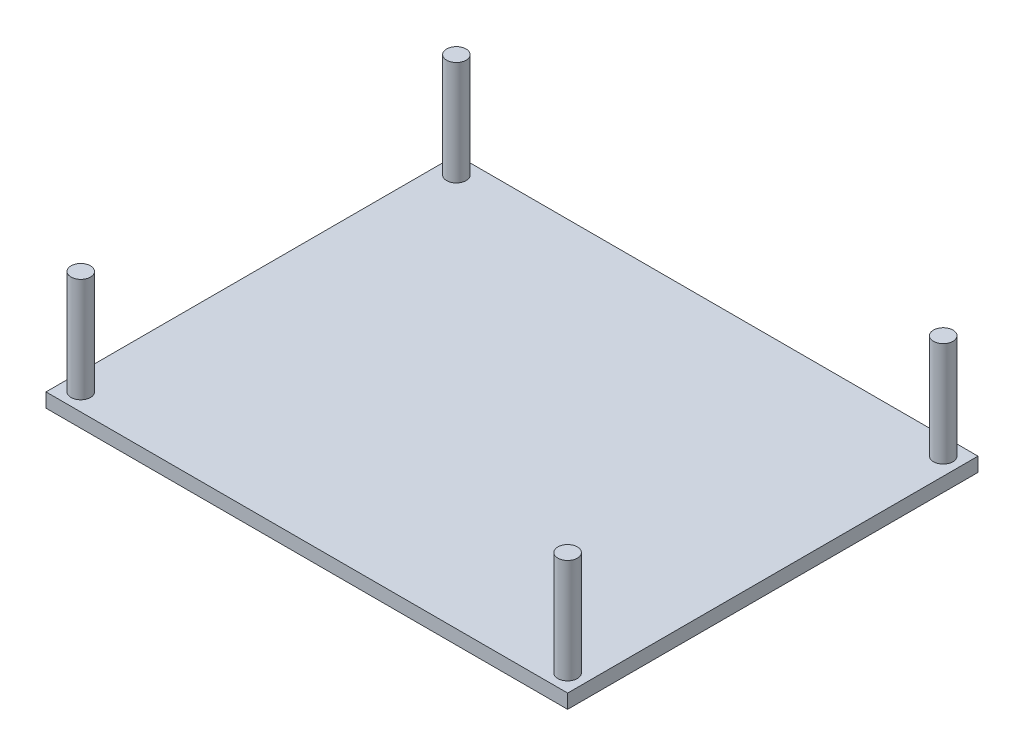
ISO-10303-21;
HEADER;
FILE_DESCRIPTION(('STEP AP214'),'2;1');
FILE_NAME('part.step','',(''),(''),'','','');
FILE_SCHEMA(('AUTOMOTIVE_DESIGN { 1 0 10303 214 1 1 1 1 }'));
ENDSEC;
DATA;
#1=APPLICATION_CONTEXT('core data for automotive mechanical design processes');
#2=APPLICATION_PROTOCOL_DEFINITION('international standard','automotive_design',2000,#1);
#3=PRODUCT_CONTEXT('',#1,'mechanical');
#4=PRODUCT('Part','Part','',(#3));
#5=PRODUCT_RELATED_PRODUCT_CATEGORY('part','',(#4));
#6=PRODUCT_DEFINITION_FORMATION('','',#4);
#7=PRODUCT_DEFINITION_CONTEXT('part definition',#1,'design');
#8=PRODUCT_DEFINITION('design','',#6,#7);
#9=PRODUCT_DEFINITION_SHAPE('','',#8);
#10=(LENGTH_UNIT() NAMED_UNIT(*) SI_UNIT(.MILLI.,.METRE.));
#11=(NAMED_UNIT(*) PLANE_ANGLE_UNIT() SI_UNIT($,.RADIAN.));
#12=(NAMED_UNIT(*) SI_UNIT($,.STERADIAN.) SOLID_ANGLE_UNIT());
#13=UNCERTAINTY_MEASURE_WITH_UNIT(LENGTH_MEASURE(1.E-05),#10,'distance_accuracy_value','');
#14=(GEOMETRIC_REPRESENTATION_CONTEXT(3) GLOBAL_UNCERTAINTY_ASSIGNED_CONTEXT((#13)) GLOBAL_UNIT_ASSIGNED_CONTEXT((#10,
#11,#12)) REPRESENTATION_CONTEXT('',''));
#15=CARTESIAN_POINT('',(0.,0.,0.));
#16=DIRECTION('',(0.,0.,1.));
#17=DIRECTION('',(1.,0.,0.));
#18=AXIS2_PLACEMENT_3D('',#15,#16,#17);
#19=CARTESIAN_POINT('',(0.,-2.032,0.));
#20=DIRECTION('',(-1.,0.,0.));
#21=DIRECTION('',(0.,0.,1.));
#22=AXIS2_PLACEMENT_3D('',#19,#20,#21);
#23=PLANE('',#22);
#24=DIRECTION('',(0.,0.,1.));
#25=VECTOR('',#24,1.);
#26=CARTESIAN_POINT('',(0.,0.,0.));
#27=LINE('',#26,#25);
#28=CARTESIAN_POINT('',(0.,0.,-59.));
#29=VERTEX_POINT('',#28);
#30=CARTESIAN_POINT('',(0.,0.,0.));
#31=VERTEX_POINT('',#30);
#32=EDGE_CURVE('E101',#29,#31,#27,.T.);
#33=ORIENTED_EDGE('',*,*,#32,.F.);
#34=DIRECTION('',(0.,1.,0.));
#35=VECTOR('',#34,1.);
#36=CARTESIAN_POINT('',(0.,-2.032,-59.));
#37=LINE('',#36,#35);
#38=CARTESIAN_POINT('',(0.,-2.032,-59.));
#39=VERTEX_POINT('',#38);
#40=EDGE_CURVE('E49',#39,#29,#37,.T.);
#41=ORIENTED_EDGE('',*,*,#40,.F.);
#42=DIRECTION('',(0.,0.,1.));
#43=VECTOR('',#42,1.);
#44=CARTESIAN_POINT('',(0.,-2.032,0.));
#45=LINE('',#44,#43);
#46=CARTESIAN_POINT('',(0.,-2.032,0.));
#47=VERTEX_POINT('',#46);
#48=EDGE_CURVE('E94',#39,#47,#45,.T.);
#49=ORIENTED_EDGE('',*,*,#48,.T.);
#50=DIRECTION('',(0.,1.,0.));
#51=VECTOR('',#50,1.);
#52=CARTESIAN_POINT('',(0.,-2.032,0.));
#53=LINE('',#52,#51);
#54=EDGE_CURVE('E77',#47,#31,#53,.T.);
#55=ORIENTED_EDGE('',*,*,#54,.T.);
#56=EDGE_LOOP('',(#33,#41,#49,#55));
#57=FACE_BOUND('',#56,.T.);
#58=ADVANCED_FACE('F33',(#57),#23,.T.);
#59=CARTESIAN_POINT('',(0.,-2.032,-59.));
#60=DIRECTION('',(0.,0.,-1.));
#61=DIRECTION('',(-1.,0.,0.));
#62=AXIS2_PLACEMENT_3D('',#59,#60,#61);
#63=PLANE('',#62);
#64=DIRECTION('',(-1.,0.,0.));
#65=VECTOR('',#64,1.);
#66=CARTESIAN_POINT('',(0.,0.,-59.));
#67=LINE('',#66,#65);
#68=CARTESIAN_POINT('',(75.,0.,-59.));
#69=VERTEX_POINT('',#68);
#70=EDGE_CURVE('E96',#69,#29,#67,.T.);
#71=ORIENTED_EDGE('',*,*,#70,.F.);
#72=DIRECTION('',(0.,1.,0.));
#73=VECTOR('',#72,1.);
#74=CARTESIAN_POINT('',(75.,-2.032,-59.));
#75=LINE('',#74,#73);
#76=CARTESIAN_POINT('',(75.,-2.032,-59.));
#77=VERTEX_POINT('',#76);
#78=EDGE_CURVE('E66',#77,#69,#75,.T.);
#79=ORIENTED_EDGE('',*,*,#78,.F.);
#80=DIRECTION('',(-1.,0.,0.));
#81=VECTOR('',#80,1.);
#82=CARTESIAN_POINT('',(0.,-2.032,-59.));
#83=LINE('',#82,#81);
#84=EDGE_CURVE('E91',#77,#39,#83,.T.);
#85=ORIENTED_EDGE('',*,*,#84,.T.);
#86=ORIENTED_EDGE('',*,*,#40,.T.);
#87=EDGE_LOOP('',(#71,#79,#85,#86));
#88=FACE_BOUND('',#87,.T.);
#89=ADVANCED_FACE('F133',(#88),#63,.T.);
#90=CARTESIAN_POINT('',(75.,-2.032,0.));
#91=DIRECTION('',(1.,0.,0.));
#92=DIRECTION('',(0.,0.,-1.));
#93=AXIS2_PLACEMENT_3D('',#90,#91,#92);
#94=PLANE('',#93);
#95=DIRECTION('',(0.,0.,-1.));
#96=VECTOR('',#95,1.);
#97=CARTESIAN_POINT('',(75.,0.,0.));
#98=LINE('',#97,#96);
#99=CARTESIAN_POINT('',(75.,0.,0.));
#100=VERTEX_POINT('',#99);
#101=EDGE_CURVE('E85',#100,#69,#98,.T.);
#102=ORIENTED_EDGE('',*,*,#101,.F.);
#103=DIRECTION('',(0.,1.,0.));
#104=VECTOR('',#103,1.);
#105=CARTESIAN_POINT('',(75.,-2.032,0.));
#106=LINE('',#105,#104);
#107=CARTESIAN_POINT('',(75.,-2.032,0.));
#108=VERTEX_POINT('',#107);
#109=EDGE_CURVE('E80',#108,#100,#106,.T.);
#110=ORIENTED_EDGE('',*,*,#109,.F.);
#111=DIRECTION('',(0.,0.,-1.));
#112=VECTOR('',#111,1.);
#113=CARTESIAN_POINT('',(75.,-2.032,0.));
#114=LINE('',#113,#112);
#115=EDGE_CURVE('E83',#108,#77,#114,.T.);
#116=ORIENTED_EDGE('',*,*,#115,.T.);
#117=ORIENTED_EDGE('',*,*,#78,.T.);
#118=EDGE_LOOP('',(#102,#110,#116,#117));
#119=FACE_BOUND('',#118,.T.);
#120=ADVANCED_FACE('F82',(#119),#94,.T.);
#121=CARTESIAN_POINT('',(0.,-2.032,0.));
#122=DIRECTION('',(0.,0.,1.));
#123=DIRECTION('',(1.,0.,0.));
#124=AXIS2_PLACEMENT_3D('',#121,#122,#123);
#125=PLANE('',#124);
#126=DIRECTION('',(1.,0.,0.));
#127=VECTOR('',#126,1.);
#128=CARTESIAN_POINT('',(0.,0.,0.));
#129=LINE('',#128,#127);
#130=EDGE_CURVE('E104',#31,#100,#129,.T.);
#131=ORIENTED_EDGE('',*,*,#130,.F.);
#132=ORIENTED_EDGE('',*,*,#54,.F.);
#133=DIRECTION('',(1.,0.,0.));
#134=VECTOR('',#133,1.);
#135=CARTESIAN_POINT('',(0.,-2.032,0.));
#136=LINE('',#135,#134);
#137=EDGE_CURVE('E90',#47,#108,#136,.T.);
#138=ORIENTED_EDGE('',*,*,#137,.T.);
#139=ORIENTED_EDGE('',*,*,#109,.T.);
#140=EDGE_LOOP('',(#131,#132,#138,#139));
#141=FACE_BOUND('',#140,.T.);
#142=ADVANCED_FACE('F93',(#141),#125,.T.);
#143=CARTESIAN_POINT('',(0.,-2.032,0.));
#144=DIRECTION('',(0.,-1.,0.));
#145=DIRECTION('',(0.,0.,-1.));
#146=AXIS2_PLACEMENT_3D('',#143,#144,#145);
#147=PLANE('',#146);
#148=ORIENTED_EDGE('',*,*,#48,.F.);
#149=ORIENTED_EDGE('',*,*,#84,.F.);
#150=ORIENTED_EDGE('',*,*,#115,.F.);
#151=ORIENTED_EDGE('',*,*,#137,.F.);
#152=EDGE_LOOP('',(#148,#149,#150,#151));
#153=FACE_BOUND('',#152,.T.);
#154=ADVANCED_FACE('F89',(#153),#147,.T.);
#155=CARTESIAN_POINT('',(0.,0.,0.));
#156=DIRECTION('',(0.,-1.,0.));
#157=DIRECTION('',(0.,0.,-1.));
#158=AXIS2_PLACEMENT_3D('',#155,#156,#157);
#159=PLANE('',#158);
#160=CARTESIAN_POINT('',(2.5,0.,-56.5));
#161=DIRECTION('',(0.,-1.,0.));
#162=DIRECTION('',(0.,0.,-1.));
#163=AXIS2_PLACEMENT_3D('',#160,#161,#162);
#164=CIRCLE('',#163,1.399999994);
#165=CARTESIAN_POINT('',(2.5,0.,-57.899999994));
#166=VERTEX_POINT('',#165);
#167=EDGE_CURVE('E11',#166,#166,#164,.F.);
#168=ORIENTED_EDGE('',*,*,#167,.F.);
#169=EDGE_LOOP('',(#168));
#170=FACE_BOUND('',#169,.T.);
#171=CARTESIAN_POINT('',(72.5,0.,-56.5));
#172=DIRECTION('',(0.,-1.,0.));
#173=DIRECTION('',(0.,0.,-1.));
#174=AXIS2_PLACEMENT_3D('',#171,#172,#173);
#175=CIRCLE('',#174,1.4);
#176=CARTESIAN_POINT('',(72.5,0.,-57.9));
#177=VERTEX_POINT('',#176);
#178=EDGE_CURVE('E41',#177,#177,#175,.F.);
#179=ORIENTED_EDGE('',*,*,#178,.F.);
#180=EDGE_LOOP('',(#179));
#181=FACE_BOUND('',#180,.T.);
#182=CARTESIAN_POINT('',(72.5,0.,-2.5));
#183=DIRECTION('',(0.,-1.,0.));
#184=DIRECTION('',(0.,0.,-1.));
#185=AXIS2_PLACEMENT_3D('',#182,#183,#184);
#186=CIRCLE('',#185,1.4);
#187=CARTESIAN_POINT('',(72.5,0.,-3.90000000000001));
#188=VERTEX_POINT('',#187);
#189=EDGE_CURVE('E116',#188,#188,#186,.F.);
#190=ORIENTED_EDGE('',*,*,#189,.F.);
#191=EDGE_LOOP('',(#190));
#192=FACE_BOUND('',#191,.T.);
#193=CARTESIAN_POINT('',(2.5,0.,-2.5));
#194=DIRECTION('',(0.,-1.,0.));
#195=DIRECTION('',(0.,0.,-1.));
#196=AXIS2_PLACEMENT_3D('',#193,#194,#195);
#197=CIRCLE('',#196,1.399999994);
#198=CARTESIAN_POINT('',(2.5,0.,-3.899999994));
#199=VERTEX_POINT('',#198);
#200=EDGE_CURVE('E111',#199,#199,#197,.F.);
#201=ORIENTED_EDGE('',*,*,#200,.F.);
#202=EDGE_LOOP('',(#201));
#203=FACE_BOUND('',#202,.T.);
#204=ORIENTED_EDGE('',*,*,#32,.T.);
#205=ORIENTED_EDGE('',*,*,#130,.T.);
#206=ORIENTED_EDGE('',*,*,#101,.T.);
#207=ORIENTED_EDGE('',*,*,#70,.T.);
#208=EDGE_LOOP('',(#204,#205,#206,#207));
#209=FACE_BOUND('',#208,.T.);
#210=ADVANCED_FACE('F123',(#170,#181,#192,#203,#209),#159,.F.);
#211=CARTESIAN_POINT('',(2.5,15.,-2.5));
#212=DIRECTION('',(0.,-1.,0.));
#213=DIRECTION('',(0.,0.,-1.));
#214=AXIS2_PLACEMENT_3D('',#211,#212,#213);
#215=CYLINDRICAL_SURFACE('',#214,1.399999994);
#216=CARTESIAN_POINT('',(2.5,15.,-2.5));
#217=DIRECTION('',(0.,1.,0.));
#218=DIRECTION('',(0.,0.,1.));
#219=AXIS2_PLACEMENT_3D('',#216,#217,#218);
#220=CIRCLE('',#219,1.399999994);
#221=CARTESIAN_POINT('',(2.5,15.,-1.100000006));
#222=VERTEX_POINT('',#221);
#223=EDGE_CURVE('E105',#222,#222,#220,.T.);
#224=ORIENTED_EDGE('',*,*,#223,.F.);
#225=EDGE_LOOP('',(#224));
#226=FACE_BOUND('',#225,.T.);
#227=ORIENTED_EDGE('',*,*,#200,.T.);
#228=EDGE_LOOP('',(#227));
#229=FACE_BOUND('',#228,.T.);
#230=ADVANCED_FACE('F126',(#226,#229),#215,.T.);
#231=CARTESIAN_POINT('',(2.5,15.,-2.5));
#232=DIRECTION('',(0.,1.,0.));
#233=DIRECTION('',(0.,0.,1.));
#234=AXIS2_PLACEMENT_3D('',#231,#232,#233);
#235=PLANE('',#234);
#236=ORIENTED_EDGE('',*,*,#223,.T.);
#237=EDGE_LOOP('',(#236));
#238=FACE_BOUND('',#237,.T.);
#239=ADVANCED_FACE('F151',(#238),#235,.T.);
#240=CARTESIAN_POINT('',(72.5,15.,-2.5));
#241=DIRECTION('',(0.,-1.,0.));
#242=DIRECTION('',(0.,0.,-1.));
#243=AXIS2_PLACEMENT_3D('',#240,#241,#242);
#244=CYLINDRICAL_SURFACE('',#243,1.4);
#245=CARTESIAN_POINT('',(72.5,15.,-2.5));
#246=DIRECTION('',(0.,1.,0.));
#247=DIRECTION('',(0.,0.,1.));
#248=AXIS2_PLACEMENT_3D('',#245,#246,#247);
#249=CIRCLE('',#248,1.4);
#250=CARTESIAN_POINT('',(72.5,15.,-1.1));
#251=VERTEX_POINT('',#250);
#252=EDGE_CURVE('E186',#251,#251,#249,.T.);
#253=ORIENTED_EDGE('',*,*,#252,.F.);
#254=EDGE_LOOP('',(#253));
#255=FACE_BOUND('',#254,.T.);
#256=ORIENTED_EDGE('',*,*,#189,.T.);
#257=EDGE_LOOP('',(#256));
#258=FACE_BOUND('',#257,.T.);
#259=ADVANCED_FACE('F155',(#255,#258),#244,.T.);
#260=CARTESIAN_POINT('',(72.5,15.,-2.5));
#261=DIRECTION('',(0.,1.,0.));
#262=DIRECTION('',(0.,0.,1.));
#263=AXIS2_PLACEMENT_3D('',#260,#261,#262);
#264=PLANE('',#263);
#265=ORIENTED_EDGE('',*,*,#252,.T.);
#266=EDGE_LOOP('',(#265));
#267=FACE_BOUND('',#266,.T.);
#268=ADVANCED_FACE('F159',(#267),#264,.T.);
#269=CARTESIAN_POINT('',(72.5,15.,-56.5));
#270=DIRECTION('',(0.,-1.,0.));
#271=DIRECTION('',(0.,0.,-1.));
#272=AXIS2_PLACEMENT_3D('',#269,#270,#271);
#273=CYLINDRICAL_SURFACE('',#272,1.4);
#274=CARTESIAN_POINT('',(72.5,15.,-56.5));
#275=DIRECTION('',(0.,1.,0.));
#276=DIRECTION('',(0.,0.,-1.));
#277=AXIS2_PLACEMENT_3D('',#274,#275,#276);
#278=CIRCLE('',#277,1.4);
#279=CARTESIAN_POINT('',(72.5,15.,-57.9));
#280=VERTEX_POINT('',#279);
#281=EDGE_CURVE('E183',#280,#280,#278,.T.);
#282=ORIENTED_EDGE('',*,*,#281,.F.);
#283=EDGE_LOOP('',(#282));
#284=FACE_BOUND('',#283,.T.);
#285=ORIENTED_EDGE('',*,*,#178,.T.);
#286=EDGE_LOOP('',(#285));
#287=FACE_BOUND('',#286,.T.);
#288=ADVANCED_FACE('F121',(#284,#287),#273,.T.);
#289=CARTESIAN_POINT('',(72.5,15.,-56.5));
#290=DIRECTION('',(0.,-1.,0.));
#291=DIRECTION('',(0.,0.,-1.));
#292=AXIS2_PLACEMENT_3D('',#289,#290,#291);
#293=PLANE('',#292);
#294=ORIENTED_EDGE('',*,*,#281,.T.);
#295=EDGE_LOOP('',(#294));
#296=FACE_BOUND('',#295,.T.);
#297=ADVANCED_FACE('F166',(#296),#293,.F.);
#298=CARTESIAN_POINT('',(2.5,15.,-56.5));
#299=DIRECTION('',(0.,-1.,0.));
#300=DIRECTION('',(0.,0.,-1.));
#301=AXIS2_PLACEMENT_3D('',#298,#299,#300);
#302=CYLINDRICAL_SURFACE('',#301,1.399999994);
#303=CARTESIAN_POINT('',(2.5,15.,-56.5));
#304=DIRECTION('',(0.,1.,0.));
#305=DIRECTION('',(0.,0.,-1.));
#306=AXIS2_PLACEMENT_3D('',#303,#304,#305);
#307=CIRCLE('',#306,1.399999994);
#308=CARTESIAN_POINT('',(2.5,15.,-57.899999994));
#309=VERTEX_POINT('',#308);
#310=EDGE_CURVE('E182',#309,#309,#307,.T.);
#311=ORIENTED_EDGE('',*,*,#310,.F.);
#312=EDGE_LOOP('',(#311));
#313=FACE_BOUND('',#312,.T.);
#314=ORIENTED_EDGE('',*,*,#167,.T.);
#315=EDGE_LOOP('',(#314));
#316=FACE_BOUND('',#315,.T.);
#317=ADVANCED_FACE('F170',(#313,#316),#302,.T.);
#318=CARTESIAN_POINT('',(2.5,15.,-56.5));
#319=DIRECTION('',(0.,-1.,0.));
#320=DIRECTION('',(0.,0.,-1.));
#321=AXIS2_PLACEMENT_3D('',#318,#319,#320);
#322=PLANE('',#321);
#323=ORIENTED_EDGE('',*,*,#310,.T.);
#324=EDGE_LOOP('',(#323));
#325=FACE_BOUND('',#324,.T.);
#326=ADVANCED_FACE('F174',(#325),#322,.F.);
#327=CLOSED_SHELL('',(#58,#89,#120,#142,#154,#210,#230,#239,#259,#268,#288,#297,#317,#326));
#328=MANIFOLD_SOLID_BREP('B2',#327);
#329=ADVANCED_BREP_SHAPE_REPRESENTATION('',(#18,#328),#14);
#330=SHAPE_DEFINITION_REPRESENTATION(#9,#329);
ENDSEC;
END-ISO-10303-21;
